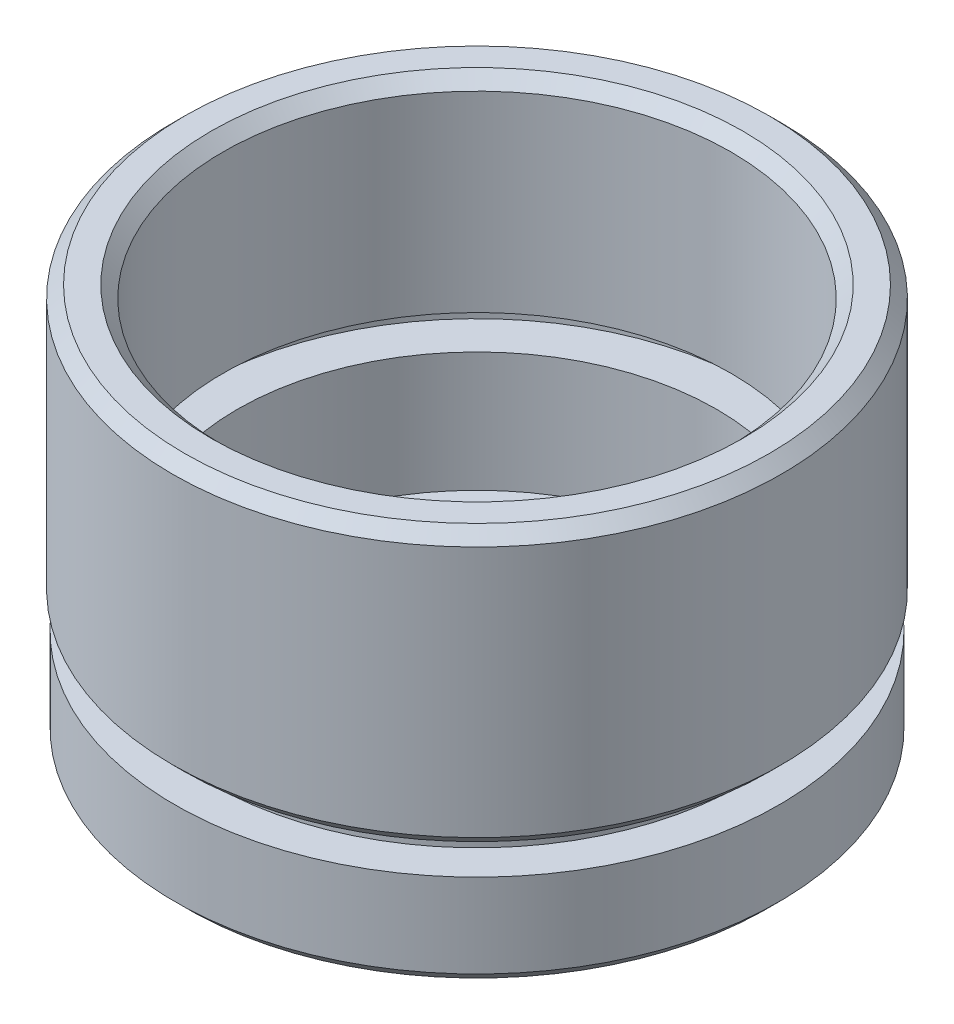
ISO-10303-21;
HEADER;
FILE_DESCRIPTION(('STEP AP214'),'2;1');
FILE_NAME('part.step','',(''),(''),'','','');
FILE_SCHEMA(('AUTOMOTIVE_DESIGN { 1 0 10303 214 1 1 1 1 }'));
ENDSEC;
DATA;
#1=APPLICATION_CONTEXT('core data for automotive mechanical design processes');
#2=APPLICATION_PROTOCOL_DEFINITION('international standard','automotive_design',2000,#1);
#3=PRODUCT_CONTEXT('',#1,'mechanical');
#4=PRODUCT('Part','Part','',(#3));
#5=PRODUCT_RELATED_PRODUCT_CATEGORY('part','',(#4));
#6=PRODUCT_DEFINITION_FORMATION('','',#4);
#7=PRODUCT_DEFINITION_CONTEXT('part definition',#1,'design');
#8=PRODUCT_DEFINITION('design','',#6,#7);
#9=PRODUCT_DEFINITION_SHAPE('','',#8);
#10=(LENGTH_UNIT() NAMED_UNIT(*) SI_UNIT(.MILLI.,.METRE.));
#11=(NAMED_UNIT(*) PLANE_ANGLE_UNIT() SI_UNIT($,.RADIAN.));
#12=(NAMED_UNIT(*) SI_UNIT($,.STERADIAN.) SOLID_ANGLE_UNIT());
#13=UNCERTAINTY_MEASURE_WITH_UNIT(LENGTH_MEASURE(1.E-05),#10,'distance_accuracy_value','');
#14=(GEOMETRIC_REPRESENTATION_CONTEXT(3) GLOBAL_UNCERTAINTY_ASSIGNED_CONTEXT((#13)) GLOBAL_UNIT_ASSIGNED_CONTEXT((#10,
#11,#12)) REPRESENTATION_CONTEXT('',''));
#15=CARTESIAN_POINT('',(0.,0.,0.));
#16=DIRECTION('',(0.,0.,1.));
#17=DIRECTION('',(1.,0.,0.));
#18=AXIS2_PLACEMENT_3D('',#15,#16,#17);
#19=CARTESIAN_POINT('',(0.,0.,0.));
#20=DIRECTION('',(0.,-1.,0.));
#21=DIRECTION('',(0.,0.,-1.));
#22=AXIS2_PLACEMENT_3D('',#19,#20,#21);
#23=CYLINDRICAL_SURFACE('',#22,9.25);
#24=CARTESIAN_POINT('',(0.,0.,0.));
#25=DIRECTION('',(0.,-1.,0.));
#26=DIRECTION('',(0.,0.,-1.));
#27=AXIS2_PLACEMENT_3D('',#24,#25,#26);
#28=CIRCLE('',#27,9.25);
#29=CARTESIAN_POINT('',(0.,0.,-9.25));
#30=VERTEX_POINT('',#29);
#31=EDGE_CURVE('E67',#30,#30,#28,.T.);
#32=ORIENTED_EDGE('',*,*,#31,.T.);
#33=EDGE_LOOP('',(#32));
#34=FACE_BOUND('',#33,.T.);
#35=CARTESIAN_POINT('',(0.,2.,0.));
#36=DIRECTION('',(0.,-1.,0.));
#37=DIRECTION('',(0.,0.,-1.));
#38=AXIS2_PLACEMENT_3D('',#35,#36,#37);
#39=CIRCLE('',#38,9.25);
#40=CARTESIAN_POINT('',(0.,2.,-9.25));
#41=VERTEX_POINT('',#40);
#42=EDGE_CURVE('E94',#41,#41,#39,.T.);
#43=ORIENTED_EDGE('',*,*,#42,.F.);
#44=EDGE_LOOP('',(#43));
#45=FACE_BOUND('',#44,.T.);
#46=ADVANCED_FACE('F35',(#34,#45),#23,.F.);
#47=CARTESIAN_POINT('',(9.25,0.,0.));
#48=DIRECTION('',(0.,-1.,0.));
#49=DIRECTION('',(0.,0.,-1.));
#50=AXIS2_PLACEMENT_3D('',#47,#48,#49);
#51=PLANE('',#50);
#52=CARTESIAN_POINT('',(0.,0.,0.));
#53=DIRECTION('',(0.,-1.,0.));
#54=DIRECTION('',(0.,0.,-1.));
#55=AXIS2_PLACEMENT_3D('',#52,#53,#54);
#56=CIRCLE('',#55,12.1);
#57=CARTESIAN_POINT('',(0.,0.,-12.1));
#58=VERTEX_POINT('',#57);
#59=EDGE_CURVE('E42',#58,#58,#56,.T.);
#60=ORIENTED_EDGE('',*,*,#59,.T.);
#61=EDGE_LOOP('',(#60));
#62=FACE_BOUND('',#61,.T.);
#63=ORIENTED_EDGE('',*,*,#31,.F.);
#64=EDGE_LOOP('',(#63));
#65=FACE_BOUND('',#64,.T.);
#66=ADVANCED_FACE('F102',(#62,#65),#51,.T.);
#67=CARTESIAN_POINT('',(0.,0.,0.));
#68=DIRECTION('',(0.,-1.,0.));
#69=DIRECTION('',(0.,0.,-1.));
#70=AXIS2_PLACEMENT_3D('',#67,#68,#69);
#71=CYLINDRICAL_SURFACE('',#70,12.6);
#72=CARTESIAN_POINT('',(0.,0.499999999999997,0.));
#73=DIRECTION('',(0.,-1.,0.));
#74=DIRECTION('',(0.,0.,-1.));
#75=AXIS2_PLACEMENT_3D('',#72,#73,#74);
#76=CIRCLE('',#75,12.6);
#77=CARTESIAN_POINT('',(0.,0.499999999999997,-12.6));
#78=VERTEX_POINT('',#77);
#79=EDGE_CURVE('E10',#78,#78,#76,.F.);
#80=ORIENTED_EDGE('',*,*,#79,.T.);
#81=EDGE_LOOP('',(#80));
#82=FACE_BOUND('',#81,.T.);
#83=CARTESIAN_POINT('',(0.,4.,0.));
#84=DIRECTION('',(0.,-1.,0.));
#85=DIRECTION('',(0.,0.,-1.));
#86=AXIS2_PLACEMENT_3D('',#83,#84,#85);
#87=CIRCLE('',#86,12.6);
#88=CARTESIAN_POINT('',(0.,4.,-12.6));
#89=VERTEX_POINT('',#88);
#90=EDGE_CURVE('E70',#89,#89,#87,.T.);
#91=ORIENTED_EDGE('',*,*,#90,.T.);
#92=EDGE_LOOP('',(#91));
#93=FACE_BOUND('',#92,.T.);
#94=ADVANCED_FACE('F108',(#82,#93),#71,.T.);
#95=CARTESIAN_POINT('',(12.6,4.,0.));
#96=DIRECTION('',(0.,1.,0.));
#97=DIRECTION('',(0.,0.,1.));
#98=AXIS2_PLACEMENT_3D('',#95,#96,#97);
#99=PLANE('',#98);
#100=CARTESIAN_POINT('',(0.,4.,0.));
#101=DIRECTION('',(0.,-1.,0.));
#102=DIRECTION('',(0.,0.,-1.));
#103=AXIS2_PLACEMENT_3D('',#100,#101,#102);
#104=CIRCLE('',#103,11.1);
#105=CARTESIAN_POINT('',(0.,4.,-11.1));
#106=VERTEX_POINT('',#105);
#107=EDGE_CURVE('E73',#106,#106,#104,.T.);
#108=ORIENTED_EDGE('',*,*,#107,.T.);
#109=EDGE_LOOP('',(#108));
#110=FACE_BOUND('',#109,.T.);
#111=ORIENTED_EDGE('',*,*,#90,.F.);
#112=EDGE_LOOP('',(#111));
#113=FACE_BOUND('',#112,.T.);
#114=ADVANCED_FACE('F140',(#110,#113),#99,.T.);
#115=CARTESIAN_POINT('',(0.,0.,0.));
#116=DIRECTION('',(0.,-1.,0.));
#117=DIRECTION('',(0.,0.,-1.));
#118=AXIS2_PLACEMENT_3D('',#115,#116,#117);
#119=CYLINDRICAL_SURFACE('',#118,11.1);
#120=CARTESIAN_POINT('',(0.,5.,0.));
#121=DIRECTION('',(0.,-1.,0.));
#122=DIRECTION('',(0.,0.,-1.));
#123=AXIS2_PLACEMENT_3D('',#120,#121,#122);
#124=CIRCLE('',#123,11.1);
#125=CARTESIAN_POINT('',(0.,5.,-11.1));
#126=VERTEX_POINT('',#125);
#127=EDGE_CURVE('E76',#126,#126,#124,.T.);
#128=ORIENTED_EDGE('',*,*,#127,.T.);
#129=EDGE_LOOP('',(#128));
#130=FACE_BOUND('',#129,.T.);
#131=ORIENTED_EDGE('',*,*,#107,.F.);
#132=EDGE_LOOP('',(#131));
#133=FACE_BOUND('',#132,.T.);
#134=ADVANCED_FACE('F134',(#130,#133),#119,.T.);
#135=CARTESIAN_POINT('',(11.1,5.,0.));
#136=DIRECTION('',(0.,-1.,0.));
#137=DIRECTION('',(0.,0.,-1.));
#138=AXIS2_PLACEMENT_3D('',#135,#136,#137);
#139=PLANE('',#138);
#140=CARTESIAN_POINT('',(0.,5.,0.));
#141=DIRECTION('',(0.,-1.,0.));
#142=DIRECTION('',(0.,0.,-1.));
#143=AXIS2_PLACEMENT_3D('',#140,#141,#142);
#144=CIRCLE('',#143,12.2);
#145=CARTESIAN_POINT('',(0.,5.,-12.2));
#146=VERTEX_POINT('',#145);
#147=EDGE_CURVE('E46',#146,#146,#144,.T.);
#148=ORIENTED_EDGE('',*,*,#147,.T.);
#149=EDGE_LOOP('',(#148));
#150=FACE_BOUND('',#149,.T.);
#151=ORIENTED_EDGE('',*,*,#127,.F.);
#152=EDGE_LOOP('',(#151));
#153=FACE_BOUND('',#152,.T.);
#154=ADVANCED_FACE('F130',(#150,#153),#139,.T.);
#155=CARTESIAN_POINT('',(0.,0.,0.));
#156=DIRECTION('',(0.,-1.,0.));
#157=DIRECTION('',(0.,0.,-1.));
#158=AXIS2_PLACEMENT_3D('',#155,#156,#157);
#159=CYLINDRICAL_SURFACE('',#158,12.7);
#160=CARTESIAN_POINT('',(0.,16.,0.));
#161=DIRECTION('',(0.,1.,0.));
#162=DIRECTION('',(0.,0.,1.));
#163=AXIS2_PLACEMENT_3D('',#160,#161,#162);
#164=CIRCLE('',#163,12.7);
#165=CARTESIAN_POINT('',(0.,16.,12.7));
#166=VERTEX_POINT('',#165);
#167=EDGE_CURVE('E50',#166,#166,#164,.F.);
#168=ORIENTED_EDGE('',*,*,#167,.T.);
#169=EDGE_LOOP('',(#168));
#170=FACE_BOUND('',#169,.T.);
#171=CARTESIAN_POINT('',(0.,5.49999999999999,0.));
#172=DIRECTION('',(0.,-1.,0.));
#173=DIRECTION('',(0.,0.,-1.));
#174=AXIS2_PLACEMENT_3D('',#171,#172,#173);
#175=CIRCLE('',#174,12.7);
#176=CARTESIAN_POINT('',(0.,5.49999999999999,-12.7));
#177=VERTEX_POINT('',#176);
#178=EDGE_CURVE('E55',#177,#177,#175,.F.);
#179=ORIENTED_EDGE('',*,*,#178,.T.);
#180=EDGE_LOOP('',(#179));
#181=FACE_BOUND('',#180,.T.);
#182=ADVANCED_FACE('F133',(#170,#181),#159,.T.);
#183=CARTESIAN_POINT('',(12.7,16.5,0.));
#184=DIRECTION('',(0.,1.,0.));
#185=DIRECTION('',(0.,0.,1.));
#186=AXIS2_PLACEMENT_3D('',#183,#184,#185);
#187=PLANE('',#186);
#188=CARTESIAN_POINT('',(0.,16.5,0.));
#189=DIRECTION('',(0.,1.,0.));
#190=DIRECTION('',(0.,0.,1.));
#191=AXIS2_PLACEMENT_3D('',#188,#189,#190);
#192=CIRCLE('',#191,11.1);
#193=CARTESIAN_POINT('',(0.,16.5,11.1));
#194=VERTEX_POINT('',#193);
#195=EDGE_CURVE('E61',#194,#194,#192,.F.);
#196=ORIENTED_EDGE('',*,*,#195,.T.);
#197=EDGE_LOOP('',(#196));
#198=FACE_BOUND('',#197,.T.);
#199=CARTESIAN_POINT('',(0.,16.5,0.));
#200=DIRECTION('',(0.,1.,0.));
#201=DIRECTION('',(0.,0.,1.));
#202=AXIS2_PLACEMENT_3D('',#199,#200,#201);
#203=CIRCLE('',#202,12.2);
#204=CARTESIAN_POINT('',(0.,16.5,12.2));
#205=VERTEX_POINT('',#204);
#206=EDGE_CURVE('E64',#205,#205,#203,.T.);
#207=ORIENTED_EDGE('',*,*,#206,.T.);
#208=EDGE_LOOP('',(#207));
#209=FACE_BOUND('',#208,.T.);
#210=ADVANCED_FACE('F155',(#198,#209),#187,.T.);
#211=CARTESIAN_POINT('',(0.,0.,0.));
#212=DIRECTION('',(0.,-1.,0.));
#213=DIRECTION('',(0.,0.,-1.));
#214=AXIS2_PLACEMENT_3D('',#211,#212,#213);
#215=CYLINDRICAL_SURFACE('',#214,10.6);
#216=CARTESIAN_POINT('',(0.,16.,0.));
#217=DIRECTION('',(0.,1.,0.));
#218=DIRECTION('',(0.,0.,1.));
#219=AXIS2_PLACEMENT_3D('',#216,#217,#218);
#220=CIRCLE('',#219,10.6);
#221=CARTESIAN_POINT('',(0.,16.,10.6));
#222=VERTEX_POINT('',#221);
#223=EDGE_CURVE('E58',#222,#222,#220,.T.);
#224=ORIENTED_EDGE('',*,*,#223,.T.);
#225=EDGE_LOOP('',(#224));
#226=FACE_BOUND('',#225,.T.);
#227=CARTESIAN_POINT('',(0.,8.,0.));
#228=DIRECTION('',(0.,-1.,0.));
#229=DIRECTION('',(0.,0.,-1.));
#230=AXIS2_PLACEMENT_3D('',#227,#228,#229);
#231=CIRCLE('',#230,10.6);
#232=CARTESIAN_POINT('',(0.,8.,-10.6));
#233=VERTEX_POINT('',#232);
#234=EDGE_CURVE('E79',#233,#233,#231,.T.);
#235=ORIENTED_EDGE('',*,*,#234,.T.);
#236=EDGE_LOOP('',(#235));
#237=FACE_BOUND('',#236,.T.);
#238=ADVANCED_FACE('F159',(#226,#237),#215,.F.);
#239=CARTESIAN_POINT('',(10.6,8.,0.));
#240=DIRECTION('',(0.,-1.,0.));
#241=DIRECTION('',(0.,0.,-1.));
#242=AXIS2_PLACEMENT_3D('',#239,#240,#241);
#243=PLANE('',#242);
#244=CARTESIAN_POINT('',(0.,8.,0.));
#245=DIRECTION('',(0.,-1.,0.));
#246=DIRECTION('',(0.,0.,-1.));
#247=AXIS2_PLACEMENT_3D('',#244,#245,#246);
#248=CIRCLE('',#247,11.7);
#249=CARTESIAN_POINT('',(0.,8.,-11.7));
#250=VERTEX_POINT('',#249);
#251=EDGE_CURVE('E82',#250,#250,#248,.T.);
#252=ORIENTED_EDGE('',*,*,#251,.T.);
#253=EDGE_LOOP('',(#252));
#254=FACE_BOUND('',#253,.T.);
#255=ORIENTED_EDGE('',*,*,#234,.F.);
#256=EDGE_LOOP('',(#255));
#257=FACE_BOUND('',#256,.T.);
#258=ADVANCED_FACE('F163',(#254,#257),#243,.T.);
#259=CARTESIAN_POINT('',(0.,0.,0.));
#260=DIRECTION('',(0.,-1.,0.));
#261=DIRECTION('',(0.,0.,-1.));
#262=AXIS2_PLACEMENT_3D('',#259,#260,#261);
#263=CYLINDRICAL_SURFACE('',#262,11.7);
#264=CARTESIAN_POINT('',(0.,7.,0.));
#265=DIRECTION('',(0.,-1.,0.));
#266=DIRECTION('',(0.,0.,-1.));
#267=AXIS2_PLACEMENT_3D('',#264,#265,#266);
#268=CIRCLE('',#267,11.7);
#269=CARTESIAN_POINT('',(0.,7.,-11.7));
#270=VERTEX_POINT('',#269);
#271=EDGE_CURVE('E85',#270,#270,#268,.T.);
#272=ORIENTED_EDGE('',*,*,#271,.T.);
#273=EDGE_LOOP('',(#272));
#274=FACE_BOUND('',#273,.T.);
#275=ORIENTED_EDGE('',*,*,#251,.F.);
#276=EDGE_LOOP('',(#275));
#277=FACE_BOUND('',#276,.T.);
#278=ADVANCED_FACE('F167',(#274,#277),#263,.F.);
#279=CARTESIAN_POINT('',(11.7,7.,0.));
#280=DIRECTION('',(0.,1.,0.));
#281=DIRECTION('',(0.,0.,1.));
#282=AXIS2_PLACEMENT_3D('',#279,#280,#281);
#283=PLANE('',#282);
#284=CARTESIAN_POINT('',(0.,7.,0.));
#285=DIRECTION('',(0.,-1.,0.));
#286=DIRECTION('',(0.,0.,-1.));
#287=AXIS2_PLACEMENT_3D('',#284,#285,#286);
#288=CIRCLE('',#287,10.);
#289=CARTESIAN_POINT('',(0.,7.,-10.));
#290=VERTEX_POINT('',#289);
#291=EDGE_CURVE('E88',#290,#290,#288,.T.);
#292=ORIENTED_EDGE('',*,*,#291,.T.);
#293=EDGE_LOOP('',(#292));
#294=FACE_BOUND('',#293,.T.);
#295=ORIENTED_EDGE('',*,*,#271,.F.);
#296=EDGE_LOOP('',(#295));
#297=FACE_BOUND('',#296,.T.);
#298=ADVANCED_FACE('F171',(#294,#297),#283,.T.);
#299=CARTESIAN_POINT('',(0.,0.,0.));
#300=DIRECTION('',(0.,-1.,0.));
#301=DIRECTION('',(0.,0.,-1.));
#302=AXIS2_PLACEMENT_3D('',#299,#300,#301);
#303=CYLINDRICAL_SURFACE('',#302,10.);
#304=CARTESIAN_POINT('',(0.,2.,0.));
#305=DIRECTION('',(0.,-1.,0.));
#306=DIRECTION('',(0.,0.,-1.));
#307=AXIS2_PLACEMENT_3D('',#304,#305,#306);
#308=CIRCLE('',#307,10.);
#309=CARTESIAN_POINT('',(0.,2.,-10.));
#310=VERTEX_POINT('',#309);
#311=EDGE_CURVE('E91',#310,#310,#308,.T.);
#312=ORIENTED_EDGE('',*,*,#311,.T.);
#313=EDGE_LOOP('',(#312));
#314=FACE_BOUND('',#313,.T.);
#315=ORIENTED_EDGE('',*,*,#291,.F.);
#316=EDGE_LOOP('',(#315));
#317=FACE_BOUND('',#316,.T.);
#318=ADVANCED_FACE('F175',(#314,#317),#303,.F.);
#319=CARTESIAN_POINT('',(10.,2.,0.));
#320=DIRECTION('',(0.,1.,0.));
#321=DIRECTION('',(0.,0.,1.));
#322=AXIS2_PLACEMENT_3D('',#319,#320,#321);
#323=PLANE('',#322);
#324=ORIENTED_EDGE('',*,*,#42,.T.);
#325=EDGE_LOOP('',(#324));
#326=FACE_BOUND('',#325,.T.);
#327=ORIENTED_EDGE('',*,*,#311,.F.);
#328=EDGE_LOOP('',(#327));
#329=FACE_BOUND('',#328,.T.);
#330=ADVANCED_FACE('F98',(#326,#329),#323,.T.);
#331=CARTESIAN_POINT('',(0.,16.5,0.));
#332=DIRECTION('',(0.,1.,0.));
#333=DIRECTION('',(0.,0.,1.));
#334=AXIS2_PLACEMENT_3D('',#331,#332,#333);
#335=CONICAL_SURFACE('',#334,11.1,0.785398163397452);
#336=ORIENTED_EDGE('',*,*,#223,.F.);
#337=EDGE_LOOP('',(#336));
#338=FACE_BOUND('',#337,.T.);
#339=ORIENTED_EDGE('',*,*,#195,.F.);
#340=EDGE_LOOP('',(#339));
#341=FACE_BOUND('',#340,.T.);
#342=ADVANCED_FACE('F112',(#338,#341),#335,.F.);
#343=CARTESIAN_POINT('',(0.,16.,0.));
#344=DIRECTION('',(0.,-1.,0.));
#345=DIRECTION('',(0.,0.,-1.));
#346=AXIS2_PLACEMENT_3D('',#343,#344,#345);
#347=CONICAL_SURFACE('',#346,12.7,0.78539816339745);
#348=ORIENTED_EDGE('',*,*,#206,.F.);
#349=EDGE_LOOP('',(#348));
#350=FACE_BOUND('',#349,.T.);
#351=ORIENTED_EDGE('',*,*,#167,.F.);
#352=EDGE_LOOP('',(#351));
#353=FACE_BOUND('',#352,.T.);
#354=ADVANCED_FACE('F115',(#350,#353),#347,.T.);
#355=CARTESIAN_POINT('',(0.,5.,0.));
#356=DIRECTION('',(0.,1.,0.));
#357=DIRECTION('',(0.,0.,1.));
#358=AXIS2_PLACEMENT_3D('',#355,#356,#357);
#359=CONICAL_SURFACE('',#358,12.2,0.785398163397443);
#360=ORIENTED_EDGE('',*,*,#178,.F.);
#361=EDGE_LOOP('',(#360));
#362=FACE_BOUND('',#361,.T.);
#363=ORIENTED_EDGE('',*,*,#147,.F.);
#364=EDGE_LOOP('',(#363));
#365=FACE_BOUND('',#364,.T.);
#366=ADVANCED_FACE('F118',(#362,#365),#359,.T.);
#367=CARTESIAN_POINT('',(0.,0.,0.));
#368=DIRECTION('',(0.,1.,0.));
#369=DIRECTION('',(0.,0.,1.));
#370=AXIS2_PLACEMENT_3D('',#367,#368,#369);
#371=CONICAL_SURFACE('',#370,12.1,0.785398163397447);
#372=ORIENTED_EDGE('',*,*,#79,.F.);
#373=EDGE_LOOP('',(#372));
#374=FACE_BOUND('',#373,.T.);
#375=ORIENTED_EDGE('',*,*,#59,.F.);
#376=EDGE_LOOP('',(#375));
#377=FACE_BOUND('',#376,.T.);
#378=ADVANCED_FACE('F37',(#374,#377),#371,.T.);
#379=CLOSED_SHELL('',(#46,#66,#94,#114,#134,#154,#182,#210,#238,#258,#278,#298,#318,#330,#342,
#354,#366,#378));
#380=MANIFOLD_SOLID_BREP('B2',#379);
#381=ADVANCED_BREP_SHAPE_REPRESENTATION('',(#18,#380),#14);
#382=SHAPE_DEFINITION_REPRESENTATION(#9,#381);
ENDSEC;
END-ISO-10303-21;
